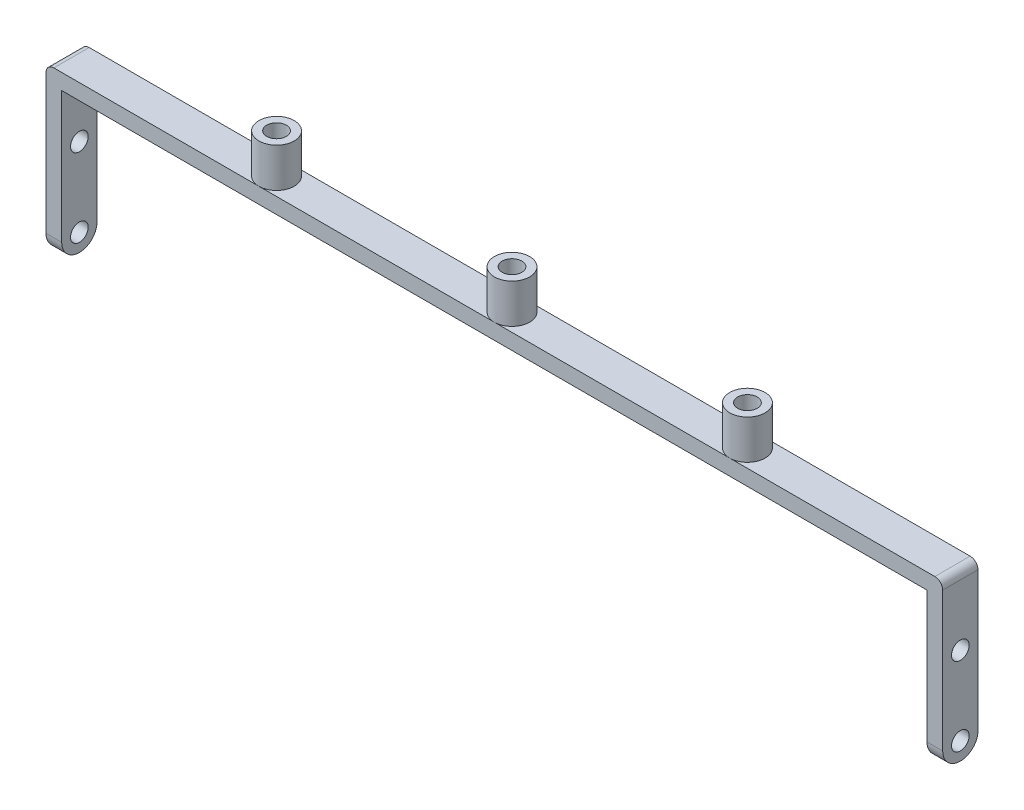
ISO-10303-21;
HEADER;
FILE_DESCRIPTION(('STEP AP214'),'2;1');
FILE_NAME('part.step','',(''),(''),'','','');
FILE_SCHEMA(('AUTOMOTIVE_DESIGN { 1 0 10303 214 1 1 1 1 }'));
ENDSEC;
DATA;
#1=APPLICATION_CONTEXT('core data for automotive mechanical design processes');
#2=APPLICATION_PROTOCOL_DEFINITION('international standard','automotive_design',2000,#1);
#3=PRODUCT_CONTEXT('',#1,'mechanical');
#4=PRODUCT('Part','Part','',(#3));
#5=PRODUCT_RELATED_PRODUCT_CATEGORY('part','',(#4));
#6=PRODUCT_DEFINITION_FORMATION('','',#4);
#7=PRODUCT_DEFINITION_CONTEXT('part definition',#1,'design');
#8=PRODUCT_DEFINITION('design','',#6,#7);
#9=PRODUCT_DEFINITION_SHAPE('','',#8);
#10=(LENGTH_UNIT() NAMED_UNIT(*) SI_UNIT(.MILLI.,.METRE.));
#11=(NAMED_UNIT(*) PLANE_ANGLE_UNIT() SI_UNIT($,.RADIAN.));
#12=(NAMED_UNIT(*) SI_UNIT($,.STERADIAN.) SOLID_ANGLE_UNIT());
#13=UNCERTAINTY_MEASURE_WITH_UNIT(LENGTH_MEASURE(1.E-05),#10,'distance_accuracy_value','');
#14=(GEOMETRIC_REPRESENTATION_CONTEXT(3) GLOBAL_UNCERTAINTY_ASSIGNED_CONTEXT((#13)) GLOBAL_UNIT_ASSIGNED_CONTEXT((#10,
#11,#12)) REPRESENTATION_CONTEXT('',''));
#15=CARTESIAN_POINT('',(0.,0.,0.));
#16=DIRECTION('',(0.,0.,1.));
#17=DIRECTION('',(1.,0.,0.));
#18=AXIS2_PLACEMENT_3D('',#15,#16,#17);
#19=CARTESIAN_POINT('',(-114.25,4.,9.));
#20=DIRECTION('',(0.,-1.,0.));
#21=DIRECTION('',(0.,0.,-1.));
#22=AXIS2_PLACEMENT_3D('',#19,#20,#21);
#23=PLANE('',#22);
#24=CARTESIAN_POINT('',(-60.,4.,4.5));
#25=DIRECTION('',(0.,1.,0.));
#26=DIRECTION('',(0.,0.,1.));
#27=AXIS2_PLACEMENT_3D('',#24,#25,#26);
#28=CIRCLE('',#27,4.5);
#29=CARTESIAN_POINT('',(-60.,4.,0.));
#30=VERTEX_POINT('',#29);
#31=CARTESIAN_POINT('',(-60.,4.,9.));
#32=VERTEX_POINT('',#31);
#33=EDGE_CURVE('E204',#30,#32,#28,.T.);
#34=ORIENTED_EDGE('',*,*,#33,.F.);
#35=DIRECTION('',(-1.,0.,0.));
#36=VECTOR('',#35,1.);
#37=CARTESIAN_POINT('',(-114.25,4.,0.));
#38=LINE('',#37,#36);
#39=CARTESIAN_POINT('',(-112.25,4.,0.));
#40=VERTEX_POINT('',#39);
#41=EDGE_CURVE('E190',#30,#40,#38,.T.);
#42=ORIENTED_EDGE('',*,*,#41,.T.);
#43=DIRECTION('',(0.,0.,-1.));
#44=VECTOR('',#43,1.);
#45=CARTESIAN_POINT('',(-112.25,4.,9.));
#46=LINE('',#45,#44);
#47=CARTESIAN_POINT('',(-112.25,4.,9.));
#48=VERTEX_POINT('',#47);
#49=EDGE_CURVE('E321',#40,#48,#46,.F.);
#50=ORIENTED_EDGE('',*,*,#49,.T.);
#51=DIRECTION('',(-1.,0.,0.));
#52=VECTOR('',#51,1.);
#53=CARTESIAN_POINT('',(-114.25,4.,9.));
#54=LINE('',#53,#52);
#55=EDGE_CURVE('E205',#32,#48,#54,.T.);
#56=ORIENTED_EDGE('',*,*,#55,.F.);
#57=EDGE_LOOP('',(#34,#42,#50,#56));
#58=FACE_BOUND('',#57,.T.);
#59=ADVANCED_FACE('F85',(#58),#23,.F.);
#60=CARTESIAN_POINT('',(60.,4.,4.5));
#61=DIRECTION('',(0.,1.,0.));
#62=DIRECTION('',(0.,0.,1.));
#63=AXIS2_PLACEMENT_3D('',#60,#61,#62);
#64=CIRCLE('',#63,4.5);
#65=CARTESIAN_POINT('',(60.,4.,0.));
#66=VERTEX_POINT('',#65);
#67=CARTESIAN_POINT('',(60.,4.,9.));
#68=VERTEX_POINT('',#67);
#69=EDGE_CURVE('E223',#66,#68,#64,.T.);
#70=ORIENTED_EDGE('',*,*,#69,.F.);
#71=CARTESIAN_POINT('',(0.,4.,0.));
#72=VERTEX_POINT('',#71);
#73=EDGE_CURVE('E189',#66,#72,#38,.T.);
#74=ORIENTED_EDGE('',*,*,#73,.T.);
#75=CARTESIAN_POINT('',(0.,4.,4.5));
#76=DIRECTION('',(0.,1.,0.));
#77=DIRECTION('',(0.,0.,1.));
#78=AXIS2_PLACEMENT_3D('',#75,#76,#77);
#79=CIRCLE('',#78,4.5);
#80=CARTESIAN_POINT('',(0.,4.,9.));
#81=VERTEX_POINT('',#80);
#82=EDGE_CURVE('E241',#81,#72,#79,.T.);
#83=ORIENTED_EDGE('',*,*,#82,.F.);
#84=EDGE_CURVE('E284',#68,#81,#54,.T.);
#85=ORIENTED_EDGE('',*,*,#84,.F.);
#86=EDGE_LOOP('',(#70,#74,#83,#85));
#87=FACE_BOUND('',#86,.T.);
#88=ADVANCED_FACE('F377',(#87),#23,.F.);
#89=EDGE_CURVE('E100',#32,#30,#28,.T.);
#90=ORIENTED_EDGE('',*,*,#89,.F.);
#91=EDGE_CURVE('E285',#81,#32,#54,.T.);
#92=ORIENTED_EDGE('',*,*,#91,.F.);
#93=EDGE_CURVE('E185',#72,#81,#79,.T.);
#94=ORIENTED_EDGE('',*,*,#93,.F.);
#95=EDGE_CURVE('E181',#72,#30,#38,.T.);
#96=ORIENTED_EDGE('',*,*,#95,.T.);
#97=EDGE_LOOP('',(#90,#92,#94,#96));
#98=FACE_BOUND('',#97,.T.);
#99=ADVANCED_FACE('F183',(#98),#23,.F.);
#100=CARTESIAN_POINT('',(-114.25,4.,9.));
#101=DIRECTION('',(1.,0.,0.));
#102=DIRECTION('',(0.,0.,-1.));
#103=AXIS2_PLACEMENT_3D('',#100,#101,#102);
#104=PLANE('',#103);
#105=CARTESIAN_POINT('',(-114.25,-13.5,4.5));
#106=DIRECTION('',(1.,0.,0.));
#107=DIRECTION('',(0.,0.,-1.));
#108=AXIS2_PLACEMENT_3D('',#105,#106,#107);
#109=CIRCLE('',#108,2.25);
#110=CARTESIAN_POINT('',(-114.25,-13.5,2.25));
#111=VERTEX_POINT('',#110);
#112=EDGE_CURVE('E252',#111,#111,#109,.T.);
#113=ORIENTED_EDGE('',*,*,#112,.T.);
#114=EDGE_LOOP('',(#113));
#115=FACE_BOUND('',#114,.T.);
#116=CARTESIAN_POINT('',(-114.25,-33.5,4.5));
#117=DIRECTION('',(1.,0.,0.));
#118=DIRECTION('',(0.,0.,-1.));
#119=AXIS2_PLACEMENT_3D('',#116,#117,#118);
#120=CIRCLE('',#119,2.25);
#121=CARTESIAN_POINT('',(-114.25,-33.5,2.25));
#122=VERTEX_POINT('',#121);
#123=EDGE_CURVE('E246',#122,#122,#120,.T.);
#124=ORIENTED_EDGE('',*,*,#123,.T.);
#125=EDGE_LOOP('',(#124));
#126=FACE_BOUND('',#125,.T.);
#127=DIRECTION('',(0.,-1.,0.));
#128=VECTOR('',#127,1.);
#129=CARTESIAN_POINT('',(-114.25,4.,9.));
#130=LINE('',#129,#128);
#131=CARTESIAN_POINT('',(-114.25,2.,9.));
#132=VERTEX_POINT('',#131);
#133=CARTESIAN_POINT('',(-114.25,-33.5,9.));
#134=VERTEX_POINT('',#133);
#135=EDGE_CURVE('E283',#132,#134,#130,.T.);
#136=ORIENTED_EDGE('',*,*,#135,.F.);
#137=DIRECTION('',(0.,0.,-1.));
#138=VECTOR('',#137,1.);
#139=CARTESIAN_POINT('',(-114.25,2.,9.));
#140=LINE('',#139,#138);
#141=CARTESIAN_POINT('',(-114.25,2.,0.));
#142=VERTEX_POINT('',#141);
#143=EDGE_CURVE('E12',#132,#142,#140,.T.);
#144=ORIENTED_EDGE('',*,*,#143,.T.);
#145=DIRECTION('',(0.,-1.,0.));
#146=VECTOR('',#145,1.);
#147=CARTESIAN_POINT('',(-114.25,4.,0.));
#148=LINE('',#147,#146);
#149=CARTESIAN_POINT('',(-114.25,-33.5,0.));
#150=VERTEX_POINT('',#149);
#151=EDGE_CURVE('E298',#142,#150,#148,.T.);
#152=ORIENTED_EDGE('',*,*,#151,.T.);
#153=CARTESIAN_POINT('',(-114.25,-33.5,4.5));
#154=DIRECTION('',(1.,0.,0.));
#155=DIRECTION('',(0.,0.,-1.));
#156=AXIS2_PLACEMENT_3D('',#153,#154,#155);
#157=CIRCLE('',#156,4.5);
#158=EDGE_CURVE('E260',#134,#150,#157,.T.);
#159=ORIENTED_EDGE('',*,*,#158,.F.);
#160=EDGE_LOOP('',(#136,#144,#152,#159));
#161=FACE_BOUND('',#160,.T.);
#162=ADVANCED_FACE('F370',(#115,#126,#161),#104,.F.);
#163=CARTESIAN_POINT('',(-110.25,0.,9.));
#164=DIRECTION('',(-1.,0.,0.));
#165=DIRECTION('',(0.,0.,1.));
#166=AXIS2_PLACEMENT_3D('',#163,#164,#165);
#167=PLANE('',#166);
#168=CARTESIAN_POINT('',(-110.25,-13.5,4.5));
#169=DIRECTION('',(-1.,0.,0.));
#170=DIRECTION('',(0.,0.,1.));
#171=AXIS2_PLACEMENT_3D('',#168,#169,#170);
#172=CIRCLE('',#171,2.25);
#173=CARTESIAN_POINT('',(-110.25,-13.5,6.75));
#174=VERTEX_POINT('',#173);
#175=EDGE_CURVE('E272',#174,#174,#172,.T.);
#176=ORIENTED_EDGE('',*,*,#175,.T.);
#177=EDGE_LOOP('',(#176));
#178=FACE_BOUND('',#177,.T.);
#179=CARTESIAN_POINT('',(-110.25,-33.5,4.5));
#180=DIRECTION('',(-1.,0.,0.));
#181=DIRECTION('',(0.,0.,1.));
#182=AXIS2_PLACEMENT_3D('',#179,#180,#181);
#183=CIRCLE('',#182,2.25);
#184=CARTESIAN_POINT('',(-110.25,-33.5,6.75));
#185=VERTEX_POINT('',#184);
#186=EDGE_CURVE('E202',#185,#185,#183,.T.);
#187=ORIENTED_EDGE('',*,*,#186,.T.);
#188=EDGE_LOOP('',(#187));
#189=FACE_BOUND('',#188,.T.);
#190=CARTESIAN_POINT('',(-110.25,-33.5,4.5));
#191=DIRECTION('',(-1.,0.,0.));
#192=DIRECTION('',(0.,0.,1.));
#193=AXIS2_PLACEMENT_3D('',#190,#191,#192);
#194=CIRCLE('',#193,4.5);
#195=CARTESIAN_POINT('',(-110.25,-33.5,0.));
#196=VERTEX_POINT('',#195);
#197=CARTESIAN_POINT('',(-110.25,-33.5,9.));
#198=VERTEX_POINT('',#197);
#199=EDGE_CURVE('E267',#196,#198,#194,.T.);
#200=ORIENTED_EDGE('',*,*,#199,.F.);
#201=DIRECTION('',(0.,1.,0.));
#202=VECTOR('',#201,1.);
#203=CARTESIAN_POINT('',(-110.25,0.,0.));
#204=LINE('',#203,#202);
#205=CARTESIAN_POINT('',(-110.25,0.,0.));
#206=VERTEX_POINT('',#205);
#207=EDGE_CURVE('E300',#196,#206,#204,.T.);
#208=ORIENTED_EDGE('',*,*,#207,.T.);
#209=DIRECTION('',(0.,0.,-1.));
#210=VECTOR('',#209,1.);
#211=CARTESIAN_POINT('',(-110.25,0.,9.));
#212=LINE('',#211,#210);
#213=CARTESIAN_POINT('',(-110.25,0.,9.));
#214=VERTEX_POINT('',#213);
#215=EDGE_CURVE('E312',#214,#206,#212,.T.);
#216=ORIENTED_EDGE('',*,*,#215,.F.);
#217=DIRECTION('',(0.,1.,0.));
#218=VECTOR('',#217,1.);
#219=CARTESIAN_POINT('',(-110.25,0.,9.));
#220=LINE('',#219,#218);
#221=EDGE_CURVE('E287',#198,#214,#220,.T.);
#222=ORIENTED_EDGE('',*,*,#221,.F.);
#223=EDGE_LOOP('',(#200,#208,#216,#222));
#224=FACE_BOUND('',#223,.T.);
#225=ADVANCED_FACE('F362',(#178,#189,#224),#167,.F.);
#226=CARTESIAN_POINT('',(110.25,0.,9.));
#227=DIRECTION('',(1.,0.,0.));
#228=DIRECTION('',(0.,0.,-1.));
#229=AXIS2_PLACEMENT_3D('',#226,#227,#228);
#230=PLANE('',#229);
#231=CARTESIAN_POINT('',(110.25,-13.5,4.5));
#232=DIRECTION('',(1.,0.,0.));
#233=DIRECTION('',(0.,0.,-1.));
#234=AXIS2_PLACEMENT_3D('',#231,#232,#233);
#235=CIRCLE('',#234,2.25);
#236=CARTESIAN_POINT('',(110.25,-13.5,2.25));
#237=VERTEX_POINT('',#236);
#238=EDGE_CURVE('E269',#237,#237,#235,.T.);
#239=ORIENTED_EDGE('',*,*,#238,.T.);
#240=EDGE_LOOP('',(#239));
#241=FACE_BOUND('',#240,.T.);
#242=CARTESIAN_POINT('',(110.25,-33.5,4.5));
#243=DIRECTION('',(1.,0.,0.));
#244=DIRECTION('',(0.,0.,-1.));
#245=AXIS2_PLACEMENT_3D('',#242,#243,#244);
#246=CIRCLE('',#245,2.25);
#247=CARTESIAN_POINT('',(110.25,-33.5,2.25));
#248=VERTEX_POINT('',#247);
#249=EDGE_CURVE('E275',#248,#248,#246,.T.);
#250=ORIENTED_EDGE('',*,*,#249,.T.);
#251=EDGE_LOOP('',(#250));
#252=FACE_BOUND('',#251,.T.);
#253=DIRECTION('',(0.,-1.,0.));
#254=VECTOR('',#253,1.);
#255=CARTESIAN_POINT('',(110.25,0.,0.));
#256=LINE('',#255,#254);
#257=CARTESIAN_POINT('',(110.25,0.,0.));
#258=VERTEX_POINT('',#257);
#259=CARTESIAN_POINT('',(110.25,-33.5,0.));
#260=VERTEX_POINT('',#259);
#261=EDGE_CURVE('E304',#258,#260,#256,.T.);
#262=ORIENTED_EDGE('',*,*,#261,.T.);
#263=CARTESIAN_POINT('',(110.25,-33.5,4.5));
#264=DIRECTION('',(1.,0.,0.));
#265=DIRECTION('',(0.,0.,-1.));
#266=AXIS2_PLACEMENT_3D('',#263,#264,#265);
#267=CIRCLE('',#266,4.5);
#268=CARTESIAN_POINT('',(110.25,-33.5,9.));
#269=VERTEX_POINT('',#268);
#270=EDGE_CURVE('E255',#269,#260,#267,.T.);
#271=ORIENTED_EDGE('',*,*,#270,.F.);
#272=DIRECTION('',(0.,-1.,0.));
#273=VECTOR('',#272,1.);
#274=CARTESIAN_POINT('',(110.25,0.,9.));
#275=LINE('',#274,#273);
#276=CARTESIAN_POINT('',(110.25,0.,9.));
#277=VERTEX_POINT('',#276);
#278=EDGE_CURVE('E291',#277,#269,#275,.T.);
#279=ORIENTED_EDGE('',*,*,#278,.F.);
#280=DIRECTION('',(0.,0.,-1.));
#281=VECTOR('',#280,1.);
#282=CARTESIAN_POINT('',(110.25,0.,9.));
#283=LINE('',#282,#281);
#284=EDGE_CURVE('E296',#277,#258,#283,.T.);
#285=ORIENTED_EDGE('',*,*,#284,.T.);
#286=EDGE_LOOP('',(#262,#271,#279,#285));
#287=FACE_BOUND('',#286,.T.);
#288=ADVANCED_FACE('F352',(#241,#252,#287),#230,.F.);
#289=CARTESIAN_POINT('',(114.25,4.,9.));
#290=DIRECTION('',(-1.,0.,0.));
#291=DIRECTION('',(0.,0.,1.));
#292=AXIS2_PLACEMENT_3D('',#289,#290,#291);
#293=PLANE('',#292);
#294=CARTESIAN_POINT('',(114.25,-13.5,4.5));
#295=DIRECTION('',(1.,0.,0.));
#296=DIRECTION('',(0.,0.,-1.));
#297=AXIS2_PLACEMENT_3D('',#294,#295,#296);
#298=CIRCLE('',#297,2.25);
#299=CARTESIAN_POINT('',(114.25,-13.5,2.25));
#300=VERTEX_POINT('',#299);
#301=EDGE_CURVE('E256',#300,#300,#298,.T.);
#302=ORIENTED_EDGE('',*,*,#301,.F.);
#303=EDGE_LOOP('',(#302));
#304=FACE_BOUND('',#303,.T.);
#305=CARTESIAN_POINT('',(114.25,-33.5,4.5));
#306=DIRECTION('',(1.,0.,0.));
#307=DIRECTION('',(0.,0.,-1.));
#308=AXIS2_PLACEMENT_3D('',#305,#306,#307);
#309=CIRCLE('',#308,2.25);
#310=CARTESIAN_POINT('',(114.25,-33.5,2.25));
#311=VERTEX_POINT('',#310);
#312=EDGE_CURVE('E245',#311,#311,#309,.T.);
#313=ORIENTED_EDGE('',*,*,#312,.F.);
#314=EDGE_LOOP('',(#313));
#315=FACE_BOUND('',#314,.T.);
#316=DIRECTION('',(0.,1.,0.));
#317=VECTOR('',#316,1.);
#318=CARTESIAN_POINT('',(114.25,4.,0.));
#319=LINE('',#318,#317);
#320=CARTESIAN_POINT('',(114.25,-33.5,0.));
#321=VERTEX_POINT('',#320);
#322=CARTESIAN_POINT('',(114.25,2.,0.));
#323=VERTEX_POINT('',#322);
#324=EDGE_CURVE('E307',#321,#323,#319,.T.);
#325=ORIENTED_EDGE('',*,*,#324,.T.);
#326=DIRECTION('',(0.,0.,-1.));
#327=VECTOR('',#326,1.);
#328=CARTESIAN_POINT('',(114.25,2.,9.));
#329=LINE('',#328,#327);
#330=CARTESIAN_POINT('',(114.25,2.,9.));
#331=VERTEX_POINT('',#330);
#332=EDGE_CURVE('E329',#323,#331,#329,.F.);
#333=ORIENTED_EDGE('',*,*,#332,.T.);
#334=DIRECTION('',(0.,1.,0.));
#335=VECTOR('',#334,1.);
#336=CARTESIAN_POINT('',(114.25,4.,9.));
#337=LINE('',#336,#335);
#338=CARTESIAN_POINT('',(114.25,-33.5,9.));
#339=VERTEX_POINT('',#338);
#340=EDGE_CURVE('E294',#339,#331,#337,.T.);
#341=ORIENTED_EDGE('',*,*,#340,.F.);
#342=CARTESIAN_POINT('',(114.25,-33.5,4.5));
#343=DIRECTION('',(1.,0.,0.));
#344=DIRECTION('',(0.,0.,-1.));
#345=AXIS2_PLACEMENT_3D('',#342,#343,#344);
#346=CIRCLE('',#345,4.5);
#347=EDGE_CURVE('E249',#339,#321,#346,.T.);
#348=ORIENTED_EDGE('',*,*,#347,.T.);
#349=EDGE_LOOP('',(#325,#333,#341,#348));
#350=FACE_BOUND('',#349,.T.);
#351=ADVANCED_FACE('F345',(#304,#315,#350),#293,.F.);
#352=EDGE_CURVE('E108',#68,#66,#64,.T.);
#353=ORIENTED_EDGE('',*,*,#352,.F.);
#354=CARTESIAN_POINT('',(112.25,4.,9.));
#355=VERTEX_POINT('',#354);
#356=EDGE_CURVE('E280',#355,#68,#54,.T.);
#357=ORIENTED_EDGE('',*,*,#356,.F.);
#358=DIRECTION('',(0.,0.,-1.));
#359=VECTOR('',#358,1.);
#360=CARTESIAN_POINT('',(112.25,4.,9.));
#361=LINE('',#360,#359);
#362=CARTESIAN_POINT('',(112.25,4.,0.));
#363=VERTEX_POINT('',#362);
#364=EDGE_CURVE('E323',#355,#363,#361,.T.);
#365=ORIENTED_EDGE('',*,*,#364,.T.);
#366=EDGE_CURVE('E192',#363,#66,#38,.T.);
#367=ORIENTED_EDGE('',*,*,#366,.T.);
#368=EDGE_LOOP('',(#353,#357,#365,#367));
#369=FACE_BOUND('',#368,.T.);
#370=ADVANCED_FACE('F340',(#369),#23,.F.);
#371=CARTESIAN_POINT('',(-110.25,0.,9.));
#372=DIRECTION('',(0.,1.,0.));
#373=DIRECTION('',(0.,0.,1.));
#374=AXIS2_PLACEMENT_3D('',#371,#372,#373);
#375=PLANE('',#374);
#376=DIRECTION('',(1.,0.,0.));
#377=VECTOR('',#376,1.);
#378=CARTESIAN_POINT('',(-110.25,0.,0.));
#379=LINE('',#378,#377);
#380=EDGE_CURVE('E302',#206,#258,#379,.T.);
#381=ORIENTED_EDGE('',*,*,#380,.T.);
#382=ORIENTED_EDGE('',*,*,#284,.F.);
#383=DIRECTION('',(1.,0.,0.));
#384=VECTOR('',#383,1.);
#385=CARTESIAN_POINT('',(-110.25,0.,9.));
#386=LINE('',#385,#384);
#387=EDGE_CURVE('E289',#214,#277,#386,.T.);
#388=ORIENTED_EDGE('',*,*,#387,.F.);
#389=ORIENTED_EDGE('',*,*,#215,.T.);
#390=EDGE_LOOP('',(#381,#382,#388,#389));
#391=FACE_BOUND('',#390,.T.);
#392=ADVANCED_FACE('F357',(#391),#375,.F.);
#393=CARTESIAN_POINT('',(0.,0.,9.));
#394=DIRECTION('',(0.,0.,-1.));
#395=DIRECTION('',(-1.,0.,0.));
#396=AXIS2_PLACEMENT_3D('',#393,#394,#395);
#397=PLANE('',#396);
#398=ORIENTED_EDGE('',*,*,#340,.T.);
#399=CARTESIAN_POINT('',(112.25,2.,9.));
#400=DIRECTION('',(0.,0.,-1.));
#401=DIRECTION('',(-1.,0.,0.));
#402=AXIS2_PLACEMENT_3D('',#399,#400,#401);
#403=CIRCLE('',#402,2.);
#404=EDGE_CURVE('E93',#331,#355,#403,.F.);
#405=ORIENTED_EDGE('',*,*,#404,.T.);
#406=ORIENTED_EDGE('',*,*,#356,.T.);
#407=ORIENTED_EDGE('',*,*,#84,.T.);
#408=ORIENTED_EDGE('',*,*,#91,.T.);
#409=ORIENTED_EDGE('',*,*,#55,.T.);
#410=CARTESIAN_POINT('',(-112.25,2.,9.));
#411=DIRECTION('',(0.,0.,-1.));
#412=DIRECTION('',(-1.,0.,0.));
#413=AXIS2_PLACEMENT_3D('',#410,#411,#412);
#414=CIRCLE('',#413,2.);
#415=EDGE_CURVE('E331',#48,#132,#414,.F.);
#416=ORIENTED_EDGE('',*,*,#415,.T.);
#417=ORIENTED_EDGE('',*,*,#135,.T.);
#418=DIRECTION('',(1.,0.,0.));
#419=VECTOR('',#418,1.);
#420=CARTESIAN_POINT('',(-114.25,-33.5,9.));
#421=LINE('',#420,#419);
#422=EDGE_CURVE('E259',#134,#198,#421,.T.);
#423=ORIENTED_EDGE('',*,*,#422,.T.);
#424=ORIENTED_EDGE('',*,*,#221,.T.);
#425=ORIENTED_EDGE('',*,*,#387,.T.);
#426=ORIENTED_EDGE('',*,*,#278,.T.);
#427=DIRECTION('',(1.,0.,0.));
#428=VECTOR('',#427,1.);
#429=CARTESIAN_POINT('',(-114.25,-33.5,9.));
#430=LINE('',#429,#428);
#431=EDGE_CURVE('E315',#269,#339,#430,.T.);
#432=ORIENTED_EDGE('',*,*,#431,.T.);
#433=EDGE_LOOP('',(#398,#405,#406,#407,#408,#409,#416,#417,#423,#424,#425,#426,#432));
#434=FACE_BOUND('',#433,.T.);
#435=ADVANCED_FACE('F334',(#434),#397,.F.);
#436=CARTESIAN_POINT('',(0.,0.,0.));
#437=DIRECTION('',(0.,0.,-1.));
#438=DIRECTION('',(-1.,0.,0.));
#439=AXIS2_PLACEMENT_3D('',#436,#437,#438);
#440=PLANE('',#439);
#441=ORIENTED_EDGE('',*,*,#366,.F.);
#442=CARTESIAN_POINT('',(112.25,2.,0.));
#443=DIRECTION('',(0.,0.,-1.));
#444=DIRECTION('',(-1.,0.,0.));
#445=AXIS2_PLACEMENT_3D('',#442,#443,#444);
#446=CIRCLE('',#445,2.);
#447=EDGE_CURVE('E327',#363,#323,#446,.T.);
#448=ORIENTED_EDGE('',*,*,#447,.T.);
#449=ORIENTED_EDGE('',*,*,#324,.F.);
#450=DIRECTION('',(1.,0.,0.));
#451=VECTOR('',#450,1.);
#452=CARTESIAN_POINT('',(-114.25,-33.5,0.));
#453=LINE('',#452,#451);
#454=EDGE_CURVE('E318',#260,#321,#453,.T.);
#455=ORIENTED_EDGE('',*,*,#454,.F.);
#456=ORIENTED_EDGE('',*,*,#261,.F.);
#457=ORIENTED_EDGE('',*,*,#380,.F.);
#458=ORIENTED_EDGE('',*,*,#207,.F.);
#459=DIRECTION('',(1.,0.,0.));
#460=VECTOR('',#459,1.);
#461=CARTESIAN_POINT('',(-114.25,-33.5,0.));
#462=LINE('',#461,#460);
#463=EDGE_CURVE('E240',#150,#196,#462,.T.);
#464=ORIENTED_EDGE('',*,*,#463,.F.);
#465=ORIENTED_EDGE('',*,*,#151,.F.);
#466=CARTESIAN_POINT('',(-112.25,2.,0.));
#467=DIRECTION('',(0.,0.,-1.));
#468=DIRECTION('',(-1.,0.,0.));
#469=AXIS2_PLACEMENT_3D('',#466,#467,#468);
#470=CIRCLE('',#469,2.);
#471=EDGE_CURVE('E198',#142,#40,#470,.T.);
#472=ORIENTED_EDGE('',*,*,#471,.T.);
#473=ORIENTED_EDGE('',*,*,#41,.F.);
#474=ORIENTED_EDGE('',*,*,#95,.F.);
#475=ORIENTED_EDGE('',*,*,#73,.F.);
#476=EDGE_LOOP('',(#441,#448,#449,#455,#456,#457,#458,#464,#465,#472,#473,#474,#475));
#477=FACE_BOUND('',#476,.T.);
#478=ADVANCED_FACE('F196',(#477),#440,.T.);
#479=CARTESIAN_POINT('',(-114.25,-33.5,4.5));
#480=DIRECTION('',(1.,0.,0.));
#481=DIRECTION('',(0.,0.,-1.));
#482=AXIS2_PLACEMENT_3D('',#479,#480,#481);
#483=CYLINDRICAL_SURFACE('',#482,4.5);
#484=ORIENTED_EDGE('',*,*,#270,.T.);
#485=ORIENTED_EDGE('',*,*,#454,.T.);
#486=ORIENTED_EDGE('',*,*,#347,.F.);
#487=ORIENTED_EDGE('',*,*,#431,.F.);
#488=EDGE_LOOP('',(#484,#485,#486,#487));
#489=FACE_BOUND('',#488,.T.);
#490=ADVANCED_FACE('F347',(#489),#483,.T.);
#491=ORIENTED_EDGE('',*,*,#199,.T.);
#492=ORIENTED_EDGE('',*,*,#422,.F.);
#493=ORIENTED_EDGE('',*,*,#158,.T.);
#494=ORIENTED_EDGE('',*,*,#463,.T.);
#495=EDGE_LOOP('',(#491,#492,#493,#494));
#496=FACE_BOUND('',#495,.T.);
#497=ADVANCED_FACE('F366',(#496),#483,.T.);
#498=CARTESIAN_POINT('',(-114.25,-13.5,4.5));
#499=DIRECTION('',(1.,0.,0.));
#500=DIRECTION('',(0.,0.,-1.));
#501=AXIS2_PLACEMENT_3D('',#498,#499,#500);
#502=CYLINDRICAL_SURFACE('',#501,2.25);
#503=ORIENTED_EDGE('',*,*,#301,.T.);
#504=EDGE_LOOP('',(#503));
#505=FACE_BOUND('',#504,.T.);
#506=ORIENTED_EDGE('',*,*,#238,.F.);
#507=EDGE_LOOP('',(#506));
#508=FACE_BOUND('',#507,.T.);
#509=ADVANCED_FACE('F580',(#505,#508),#502,.F.);
#510=CARTESIAN_POINT('',(-114.25,-33.5,4.5));
#511=DIRECTION('',(1.,0.,0.));
#512=DIRECTION('',(0.,0.,-1.));
#513=AXIS2_PLACEMENT_3D('',#510,#511,#512);
#514=CYLINDRICAL_SURFACE('',#513,2.25);
#515=ORIENTED_EDGE('',*,*,#312,.T.);
#516=EDGE_LOOP('',(#515));
#517=FACE_BOUND('',#516,.T.);
#518=ORIENTED_EDGE('',*,*,#249,.F.);
#519=EDGE_LOOP('',(#518));
#520=FACE_BOUND('',#519,.T.);
#521=ADVANCED_FACE('F586',(#517,#520),#514,.F.);
#522=ORIENTED_EDGE('',*,*,#112,.F.);
#523=EDGE_LOOP('',(#522));
#524=FACE_BOUND('',#523,.T.);
#525=ORIENTED_EDGE('',*,*,#175,.F.);
#526=EDGE_LOOP('',(#525));
#527=FACE_BOUND('',#526,.T.);
#528=ADVANCED_FACE('F589',(#524,#527),#502,.F.);
#529=ORIENTED_EDGE('',*,*,#123,.F.);
#530=EDGE_LOOP('',(#529));
#531=FACE_BOUND('',#530,.T.);
#532=ORIENTED_EDGE('',*,*,#186,.F.);
#533=EDGE_LOOP('',(#532));
#534=FACE_BOUND('',#533,.T.);
#535=ADVANCED_FACE('F597',(#531,#534),#514,.F.);
#536=CARTESIAN_POINT('',(112.25,2.,9.));
#537=DIRECTION('',(0.,0.,-1.));
#538=DIRECTION('',(-1.,0.,0.));
#539=AXIS2_PLACEMENT_3D('',#536,#537,#538);
#540=CYLINDRICAL_SURFACE('',#539,2.);
#541=ORIENTED_EDGE('',*,*,#404,.F.);
#542=ORIENTED_EDGE('',*,*,#332,.F.);
#543=ORIENTED_EDGE('',*,*,#447,.F.);
#544=ORIENTED_EDGE('',*,*,#364,.F.);
#545=EDGE_LOOP('',(#541,#542,#543,#544));
#546=FACE_BOUND('',#545,.T.);
#547=ADVANCED_FACE('F341',(#546),#540,.T.);
#548=CARTESIAN_POINT('',(-112.25,2.,9.));
#549=DIRECTION('',(0.,0.,-1.));
#550=DIRECTION('',(-1.,0.,0.));
#551=AXIS2_PLACEMENT_3D('',#548,#549,#550);
#552=CYLINDRICAL_SURFACE('',#551,2.);
#553=ORIENTED_EDGE('',*,*,#415,.F.);
#554=ORIENTED_EDGE('',*,*,#49,.F.);
#555=ORIENTED_EDGE('',*,*,#471,.F.);
#556=ORIENTED_EDGE('',*,*,#143,.F.);
#557=EDGE_LOOP('',(#553,#554,#555,#556));
#558=FACE_BOUND('',#557,.T.);
#559=ADVANCED_FACE('F87',(#558),#552,.T.);
#560=CARTESIAN_POINT('',(0.,14.,4.5));
#561=DIRECTION('',(0.,1.,0.));
#562=DIRECTION('',(0.,0.,1.));
#563=AXIS2_PLACEMENT_3D('',#560,#561,#562);
#564=PLANE('',#563);
#565=CARTESIAN_POINT('',(0.,14.,4.5));
#566=DIRECTION('',(0.,1.,0.));
#567=DIRECTION('',(0.,0.,1.));
#568=AXIS2_PLACEMENT_3D('',#565,#566,#567);
#569=CIRCLE('',#568,4.5);
#570=CARTESIAN_POINT('',(0.,14.,9.));
#571=VERTEX_POINT('',#570);
#572=EDGE_CURVE('E237',#571,#571,#569,.T.);
#573=ORIENTED_EDGE('',*,*,#572,.T.);
#574=EDGE_LOOP('',(#573));
#575=FACE_BOUND('',#574,.T.);
#576=CARTESIAN_POINT('',(0.,14.,4.5));
#577=DIRECTION('',(0.,1.,0.));
#578=DIRECTION('',(0.,0.,1.));
#579=AXIS2_PLACEMENT_3D('',#576,#577,#578);
#580=CIRCLE('',#579,2.5);
#581=CARTESIAN_POINT('',(0.,14.,7.));
#582=VERTEX_POINT('',#581);
#583=EDGE_CURVE('E232',#582,#582,#580,.T.);
#584=ORIENTED_EDGE('',*,*,#583,.F.);
#585=EDGE_LOOP('',(#584));
#586=FACE_BOUND('',#585,.T.);
#587=ADVANCED_FACE('F382',(#575,#586),#564,.T.);
#588=CARTESIAN_POINT('',(0.,14.,4.5));
#589=DIRECTION('',(0.,-1.,0.));
#590=DIRECTION('',(0.,0.,-1.));
#591=AXIS2_PLACEMENT_3D('',#588,#589,#590);
#592=CYLINDRICAL_SURFACE('',#591,4.5);
#593=ORIENTED_EDGE('',*,*,#572,.F.);
#594=EDGE_LOOP('',(#593));
#595=FACE_BOUND('',#594,.T.);
#596=ORIENTED_EDGE('',*,*,#82,.T.);
#597=ORIENTED_EDGE('',*,*,#93,.T.);
#598=EDGE_LOOP('',(#596,#597));
#599=FACE_BOUND('',#598,.T.);
#600=ADVANCED_FACE('F379',(#595,#599),#592,.T.);
#601=CARTESIAN_POINT('',(0.,14.,4.5));
#602=DIRECTION('',(0.,-1.,0.));
#603=DIRECTION('',(0.,0.,-1.));
#604=AXIS2_PLACEMENT_3D('',#601,#602,#603);
#605=CYLINDRICAL_SURFACE('',#604,2.5);
#606=ORIENTED_EDGE('',*,*,#583,.T.);
#607=EDGE_LOOP('',(#606));
#608=FACE_BOUND('',#607,.T.);
#609=CARTESIAN_POINT('',(0.,4.,4.5));
#610=DIRECTION('',(0.,1.,0.));
#611=DIRECTION('',(0.,0.,1.));
#612=AXIS2_PLACEMENT_3D('',#609,#610,#611);
#613=CIRCLE('',#612,2.5);
#614=CARTESIAN_POINT('',(0.,4.,7.));
#615=VERTEX_POINT('',#614);
#616=EDGE_CURVE('E229',#615,#615,#613,.T.);
#617=ORIENTED_EDGE('',*,*,#616,.F.);
#618=EDGE_LOOP('',(#617));
#619=FACE_BOUND('',#618,.T.);
#620=ADVANCED_FACE('F381',(#608,#619),#605,.F.);
#621=ORIENTED_EDGE('',*,*,#616,.T.);
#622=EDGE_LOOP('',(#621));
#623=FACE_BOUND('',#622,.T.);
#624=ADVANCED_FACE('F389',(#623),#23,.F.);
#625=CARTESIAN_POINT('',(60.,14.,4.5));
#626=DIRECTION('',(0.,1.,0.));
#627=DIRECTION('',(0.,0.,1.));
#628=AXIS2_PLACEMENT_3D('',#625,#626,#627);
#629=PLANE('',#628);
#630=CARTESIAN_POINT('',(60.,14.,4.5));
#631=DIRECTION('',(0.,1.,0.));
#632=DIRECTION('',(0.,0.,1.));
#633=AXIS2_PLACEMENT_3D('',#630,#631,#632);
#634=CIRCLE('',#633,4.5);
#635=CARTESIAN_POINT('',(60.,14.,9.00000000000001));
#636=VERTEX_POINT('',#635);
#637=EDGE_CURVE('E219',#636,#636,#634,.T.);
#638=ORIENTED_EDGE('',*,*,#637,.T.);
#639=EDGE_LOOP('',(#638));
#640=FACE_BOUND('',#639,.T.);
#641=CARTESIAN_POINT('',(60.,14.,4.5));
#642=DIRECTION('',(0.,1.,0.));
#643=DIRECTION('',(0.,0.,1.));
#644=AXIS2_PLACEMENT_3D('',#641,#642,#643);
#645=CIRCLE('',#644,2.5);
#646=CARTESIAN_POINT('',(60.,14.,7.));
#647=VERTEX_POINT('',#646);
#648=EDGE_CURVE('E222',#647,#647,#645,.T.);
#649=ORIENTED_EDGE('',*,*,#648,.F.);
#650=EDGE_LOOP('',(#649));
#651=FACE_BOUND('',#650,.T.);
#652=ADVANCED_FACE('F419',(#640,#651),#629,.T.);
#653=CARTESIAN_POINT('',(60.,14.,4.5));
#654=DIRECTION('',(0.,-1.,0.));
#655=DIRECTION('',(0.,0.,-1.));
#656=AXIS2_PLACEMENT_3D('',#653,#654,#655);
#657=CYLINDRICAL_SURFACE('',#656,4.5);
#658=ORIENTED_EDGE('',*,*,#637,.F.);
#659=EDGE_LOOP('',(#658));
#660=FACE_BOUND('',#659,.T.);
#661=ORIENTED_EDGE('',*,*,#352,.T.);
#662=ORIENTED_EDGE('',*,*,#69,.T.);
#663=EDGE_LOOP('',(#661,#662));
#664=FACE_BOUND('',#663,.T.);
#665=ADVANCED_FACE('F424',(#660,#664),#657,.T.);
#666=CARTESIAN_POINT('',(60.,14.,4.5));
#667=DIRECTION('',(0.,-1.,0.));
#668=DIRECTION('',(0.,0.,-1.));
#669=AXIS2_PLACEMENT_3D('',#666,#667,#668);
#670=CYLINDRICAL_SURFACE('',#669,2.5);
#671=ORIENTED_EDGE('',*,*,#648,.T.);
#672=EDGE_LOOP('',(#671));
#673=FACE_BOUND('',#672,.T.);
#674=CARTESIAN_POINT('',(60.,4.,4.5));
#675=DIRECTION('',(0.,1.,0.));
#676=DIRECTION('',(0.,0.,1.));
#677=AXIS2_PLACEMENT_3D('',#674,#675,#676);
#678=CIRCLE('',#677,2.5);
#679=CARTESIAN_POINT('',(60.,4.,7.));
#680=VERTEX_POINT('',#679);
#681=EDGE_CURVE('E226',#680,#680,#678,.T.);
#682=ORIENTED_EDGE('',*,*,#681,.F.);
#683=EDGE_LOOP('',(#682));
#684=FACE_BOUND('',#683,.T.);
#685=ADVANCED_FACE('F433',(#673,#684),#670,.F.);
#686=ORIENTED_EDGE('',*,*,#681,.T.);
#687=EDGE_LOOP('',(#686));
#688=FACE_BOUND('',#687,.T.);
#689=ADVANCED_FACE('F403',(#688),#23,.F.);
#690=CARTESIAN_POINT('',(-60.,14.,4.5));
#691=DIRECTION('',(0.,1.,0.));
#692=DIRECTION('',(0.,0.,1.));
#693=AXIS2_PLACEMENT_3D('',#690,#691,#692);
#694=PLANE('',#693);
#695=CARTESIAN_POINT('',(-60.,14.,4.5));
#696=DIRECTION('',(0.,1.,0.));
#697=DIRECTION('',(0.,0.,1.));
#698=AXIS2_PLACEMENT_3D('',#695,#696,#697);
#699=CIRCLE('',#698,4.5);
#700=CARTESIAN_POINT('',(-60.,14.,9.));
#701=VERTEX_POINT('',#700);
#702=EDGE_CURVE('E208',#701,#701,#699,.T.);
#703=ORIENTED_EDGE('',*,*,#702,.T.);
#704=EDGE_LOOP('',(#703));
#705=FACE_BOUND('',#704,.T.);
#706=CARTESIAN_POINT('',(-60.,14.,4.5));
#707=DIRECTION('',(0.,1.,0.));
#708=DIRECTION('',(0.,0.,1.));
#709=AXIS2_PLACEMENT_3D('',#706,#707,#708);
#710=CIRCLE('',#709,2.5);
#711=CARTESIAN_POINT('',(-60.,14.,7.));
#712=VERTEX_POINT('',#711);
#713=EDGE_CURVE('E211',#712,#712,#710,.T.);
#714=ORIENTED_EDGE('',*,*,#713,.F.);
#715=EDGE_LOOP('',(#714));
#716=FACE_BOUND('',#715,.T.);
#717=ADVANCED_FACE('F432',(#705,#716),#694,.T.);
#718=CARTESIAN_POINT('',(-60.,14.,4.5));
#719=DIRECTION('',(0.,-1.,0.));
#720=DIRECTION('',(0.,0.,-1.));
#721=AXIS2_PLACEMENT_3D('',#718,#719,#720);
#722=CYLINDRICAL_SURFACE('',#721,4.5);
#723=ORIENTED_EDGE('',*,*,#702,.F.);
#724=EDGE_LOOP('',(#723));
#725=FACE_BOUND('',#724,.T.);
#726=ORIENTED_EDGE('',*,*,#89,.T.);
#727=ORIENTED_EDGE('',*,*,#33,.T.);
#728=EDGE_LOOP('',(#726,#727));
#729=FACE_BOUND('',#728,.T.);
#730=ADVANCED_FACE('F210',(#725,#729),#722,.T.);
#731=CARTESIAN_POINT('',(-60.,14.,4.5));
#732=DIRECTION('',(0.,-1.,0.));
#733=DIRECTION('',(0.,0.,-1.));
#734=AXIS2_PLACEMENT_3D('',#731,#732,#733);
#735=CYLINDRICAL_SURFACE('',#734,2.5);
#736=ORIENTED_EDGE('',*,*,#713,.T.);
#737=EDGE_LOOP('',(#736));
#738=FACE_BOUND('',#737,.T.);
#739=CARTESIAN_POINT('',(-60.,4.,4.5));
#740=DIRECTION('',(0.,1.,0.));
#741=DIRECTION('',(0.,0.,1.));
#742=AXIS2_PLACEMENT_3D('',#739,#740,#741);
#743=CIRCLE('',#742,2.5);
#744=CARTESIAN_POINT('',(-60.,4.,7.));
#745=VERTEX_POINT('',#744);
#746=EDGE_CURVE('E213',#745,#745,#743,.T.);
#747=ORIENTED_EDGE('',*,*,#746,.F.);
#748=EDGE_LOOP('',(#747));
#749=FACE_BOUND('',#748,.T.);
#750=ADVANCED_FACE('F406',(#738,#749),#735,.F.);
#751=ORIENTED_EDGE('',*,*,#746,.T.);
#752=EDGE_LOOP('',(#751));
#753=FACE_BOUND('',#752,.T.);
#754=ADVANCED_FACE('F398',(#753),#23,.F.);
#755=CLOSED_SHELL('',(#59,#88,#99,#162,#225,#288,#351,#370,#392,#435,#478,#490,#497,#509,#521,
#528,#535,#547,#559,#587,#600,#620,#624,#652,#665,#685,#689,#717,#730,#750,#754));
#756=MANIFOLD_SOLID_BREP('B2',#755);
#757=ADVANCED_BREP_SHAPE_REPRESENTATION('',(#18,#756),#14);
#758=SHAPE_DEFINITION_REPRESENTATION(#9,#757);
ENDSEC;
END-ISO-10303-21;
